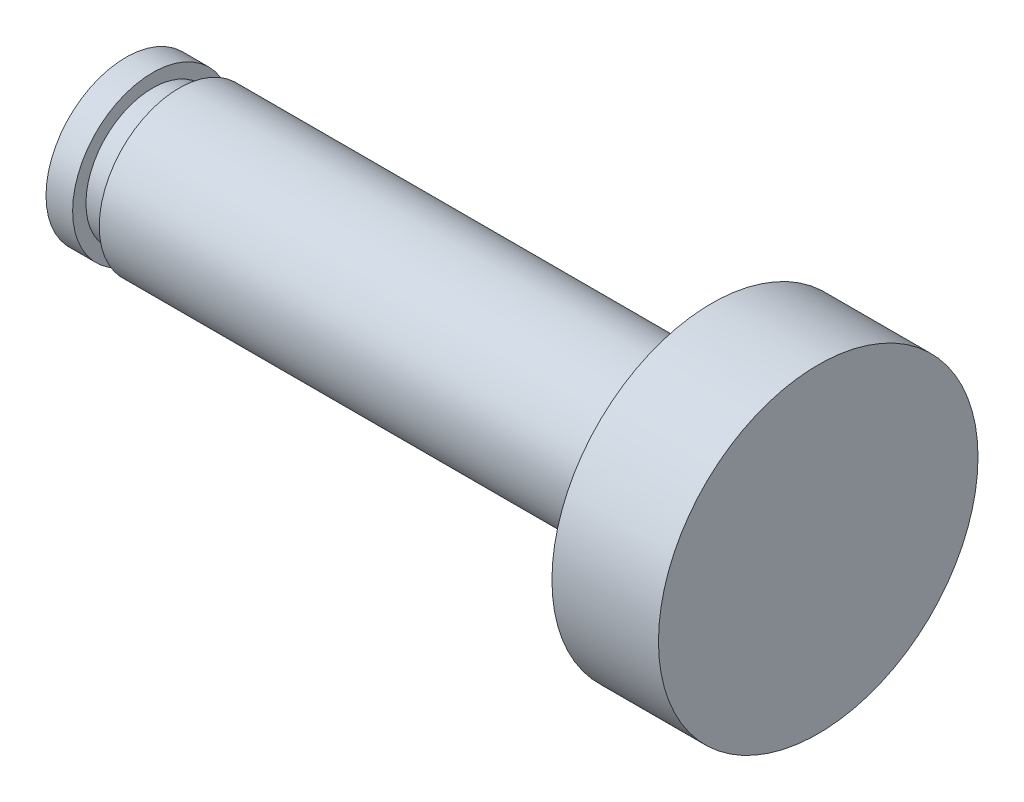
ISO-10303-21;
HEADER;
FILE_DESCRIPTION(('STEP AP214'),'2;1');
FILE_NAME('part.step','',(''),(''),'','','');
FILE_SCHEMA(('AUTOMOTIVE_DESIGN { 1 0 10303 214 1 1 1 1 }'));
ENDSEC;
DATA;
#1=APPLICATION_CONTEXT('core data for automotive mechanical design processes');
#2=APPLICATION_PROTOCOL_DEFINITION('international standard','automotive_design',2000,#1);
#3=PRODUCT_CONTEXT('',#1,'mechanical');
#4=PRODUCT('Part','Part','',(#3));
#5=PRODUCT_RELATED_PRODUCT_CATEGORY('part','',(#4));
#6=PRODUCT_DEFINITION_FORMATION('','',#4);
#7=PRODUCT_DEFINITION_CONTEXT('part definition',#1,'design');
#8=PRODUCT_DEFINITION('design','',#6,#7);
#9=PRODUCT_DEFINITION_SHAPE('','',#8);
#10=(LENGTH_UNIT() NAMED_UNIT(*) SI_UNIT(.MILLI.,.METRE.));
#11=(NAMED_UNIT(*) PLANE_ANGLE_UNIT() SI_UNIT($,.RADIAN.));
#12=(NAMED_UNIT(*) SI_UNIT($,.STERADIAN.) SOLID_ANGLE_UNIT());
#13=UNCERTAINTY_MEASURE_WITH_UNIT(LENGTH_MEASURE(1.E-05),#10,'distance_accuracy_value','');
#14=(GEOMETRIC_REPRESENTATION_CONTEXT(3) GLOBAL_UNCERTAINTY_ASSIGNED_CONTEXT((#13)) GLOBAL_UNIT_ASSIGNED_CONTEXT((#10,
#11,#12)) REPRESENTATION_CONTEXT('',''));
#15=CARTESIAN_POINT('',(0.,0.,0.));
#16=DIRECTION('',(0.,0.,1.));
#17=DIRECTION('',(1.,0.,0.));
#18=AXIS2_PLACEMENT_3D('',#15,#16,#17);
#19=CARTESIAN_POINT('',(0.,0.,-1.50000000000006));
#20=DIRECTION('',(1.,0.,0.));
#21=DIRECTION('',(0.,0.,-1.));
#22=AXIS2_PLACEMENT_3D('',#19,#20,#21);
#23=PLANE('',#22);
#24=CARTESIAN_POINT('',(1.83513322852231E-13,0.,0.));
#25=DIRECTION('',(-1.,0.,0.));
#26=DIRECTION('',(0.,0.,1.));
#27=AXIS2_PLACEMENT_3D('',#24,#25,#26);
#28=CIRCLE('',#27,1.50000000000006);
#29=CARTESIAN_POINT('',(1.83513322852231E-13,0.,1.50000000000006));
#30=VERTEX_POINT('',#29);
#31=EDGE_CURVE('E69',#30,#30,#28,.T.);
#32=ORIENTED_EDGE('',*,*,#31,.T.);
#33=EDGE_LOOP('',(#32));
#34=FACE_BOUND('',#33,.T.);
#35=ADVANCED_FACE('F41',(#34),#23,.F.);
#36=CARTESIAN_POINT('',(13.,0.,0.));
#37=DIRECTION('',(-1.,0.,0.));
#38=DIRECTION('',(0.,0.,1.));
#39=AXIS2_PLACEMENT_3D('',#36,#37,#38);
#40=PLANE('',#39);
#41=CARTESIAN_POINT('',(13.,0.,0.));
#42=DIRECTION('',(-1.,0.,0.));
#43=DIRECTION('',(0.,0.,1.));
#44=AXIS2_PLACEMENT_3D('',#41,#42,#43);
#45=CIRCLE('',#44,3.);
#46=CARTESIAN_POINT('',(13.,0.,3.));
#47=VERTEX_POINT('',#46);
#48=EDGE_CURVE('E10',#47,#47,#45,.T.);
#49=ORIENTED_EDGE('',*,*,#48,.F.);
#50=EDGE_LOOP('',(#49));
#51=FACE_BOUND('',#50,.T.);
#52=ADVANCED_FACE('F111',(#51),#40,.F.);
#53=CARTESIAN_POINT('',(0.,0.,0.));
#54=DIRECTION('',(-1.,0.,0.));
#55=DIRECTION('',(0.,0.,1.));
#56=AXIS2_PLACEMENT_3D('',#53,#54,#55);
#57=CYLINDRICAL_SURFACE('',#56,3.);
#58=CARTESIAN_POINT('',(11.,0.,0.));
#59=DIRECTION('',(-1.,0.,0.));
#60=DIRECTION('',(0.,0.,1.));
#61=AXIS2_PLACEMENT_3D('',#58,#59,#60);
#62=CIRCLE('',#61,3.);
#63=CARTESIAN_POINT('',(11.,0.,3.));
#64=VERTEX_POINT('',#63);
#65=EDGE_CURVE('E47',#64,#64,#62,.T.);
#66=ORIENTED_EDGE('',*,*,#65,.F.);
#67=EDGE_LOOP('',(#66));
#68=FACE_BOUND('',#67,.T.);
#69=ORIENTED_EDGE('',*,*,#48,.T.);
#70=EDGE_LOOP('',(#69));
#71=FACE_BOUND('',#70,.T.);
#72=ADVANCED_FACE('F106',(#68,#71),#57,.T.);
#73=CARTESIAN_POINT('',(11.,0.,-3.));
#74=DIRECTION('',(1.,0.,0.));
#75=DIRECTION('',(0.,0.,-1.));
#76=AXIS2_PLACEMENT_3D('',#73,#74,#75);
#77=PLANE('',#76);
#78=CARTESIAN_POINT('',(11.,0.,0.));
#79=DIRECTION('',(-1.,0.,0.));
#80=DIRECTION('',(0.,0.,1.));
#81=AXIS2_PLACEMENT_3D('',#78,#79,#80);
#82=CIRCLE('',#81,1.5);
#83=CARTESIAN_POINT('',(11.,0.,1.5));
#84=VERTEX_POINT('',#83);
#85=EDGE_CURVE('E51',#84,#84,#82,.T.);
#86=ORIENTED_EDGE('',*,*,#85,.F.);
#87=EDGE_LOOP('',(#86));
#88=FACE_BOUND('',#87,.T.);
#89=ORIENTED_EDGE('',*,*,#65,.T.);
#90=EDGE_LOOP('',(#89));
#91=FACE_BOUND('',#90,.T.);
#92=ADVANCED_FACE('F101',(#88,#91),#77,.F.);
#93=CARTESIAN_POINT('',(0.,0.,0.));
#94=DIRECTION('',(-1.,0.,0.));
#95=DIRECTION('',(0.,0.,1.));
#96=AXIS2_PLACEMENT_3D('',#93,#94,#95);
#97=CYLINDRICAL_SURFACE('',#96,1.5);
#98=CARTESIAN_POINT('',(0.999999999999999,0.,0.));
#99=DIRECTION('',(-1.,0.,0.));
#100=DIRECTION('',(0.,0.,1.));
#101=AXIS2_PLACEMENT_3D('',#98,#99,#100);
#102=CIRCLE('',#101,1.5);
#103=CARTESIAN_POINT('',(0.999999999999999,0.,1.5));
#104=VERTEX_POINT('',#103);
#105=EDGE_CURVE('E55',#104,#104,#102,.T.);
#106=ORIENTED_EDGE('',*,*,#105,.F.);
#107=EDGE_LOOP('',(#106));
#108=FACE_BOUND('',#107,.T.);
#109=ORIENTED_EDGE('',*,*,#85,.T.);
#110=EDGE_LOOP('',(#109));
#111=FACE_BOUND('',#110,.T.);
#112=ADVANCED_FACE('F95',(#108,#111),#97,.T.);
#113=CARTESIAN_POINT('',(0.999999999999999,0.,-1.5));
#114=DIRECTION('',(1.,0.,0.));
#115=DIRECTION('',(0.,0.,-1.));
#116=AXIS2_PLACEMENT_3D('',#113,#114,#115);
#117=PLANE('',#116);
#118=CARTESIAN_POINT('',(0.999999999999999,0.,0.));
#119=DIRECTION('',(-1.,0.,0.));
#120=DIRECTION('',(0.,0.,1.));
#121=AXIS2_PLACEMENT_3D('',#118,#119,#120);
#122=CIRCLE('',#121,1.25);
#123=CARTESIAN_POINT('',(0.999999999999999,0.,1.25));
#124=VERTEX_POINT('',#123);
#125=EDGE_CURVE('E60',#124,#124,#122,.T.);
#126=ORIENTED_EDGE('',*,*,#125,.F.);
#127=EDGE_LOOP('',(#126));
#128=FACE_BOUND('',#127,.T.);
#129=ORIENTED_EDGE('',*,*,#105,.T.);
#130=EDGE_LOOP('',(#129));
#131=FACE_BOUND('',#130,.T.);
#132=ADVANCED_FACE('F89',(#128,#131),#117,.F.);
#133=CARTESIAN_POINT('',(0.,0.,0.));
#134=DIRECTION('',(-1.,0.,0.));
#135=DIRECTION('',(0.,0.,1.));
#136=AXIS2_PLACEMENT_3D('',#133,#134,#135);
#137=CYLINDRICAL_SURFACE('',#136,1.25);
#138=CARTESIAN_POINT('',(0.5,0.,0.));
#139=DIRECTION('',(-1.,0.,0.));
#140=DIRECTION('',(0.,0.,1.));
#141=AXIS2_PLACEMENT_3D('',#138,#139,#140);
#142=CIRCLE('',#141,1.25);
#143=CARTESIAN_POINT('',(0.5,0.,1.25));
#144=VERTEX_POINT('',#143);
#145=EDGE_CURVE('E63',#144,#144,#142,.T.);
#146=ORIENTED_EDGE('',*,*,#145,.F.);
#147=EDGE_LOOP('',(#146));
#148=FACE_BOUND('',#147,.T.);
#149=ORIENTED_EDGE('',*,*,#125,.T.);
#150=EDGE_LOOP('',(#149));
#151=FACE_BOUND('',#150,.T.);
#152=ADVANCED_FACE('F83',(#148,#151),#137,.T.);
#153=CARTESIAN_POINT('',(0.5,0.,-1.5));
#154=DIRECTION('',(-1.,0.,0.));
#155=DIRECTION('',(0.,0.,1.));
#156=AXIS2_PLACEMENT_3D('',#153,#154,#155);
#157=PLANE('',#156);
#158=CARTESIAN_POINT('',(0.5,0.,0.));
#159=DIRECTION('',(-1.,0.,0.));
#160=DIRECTION('',(0.,0.,1.));
#161=AXIS2_PLACEMENT_3D('',#158,#159,#160);
#162=CIRCLE('',#161,1.5);
#163=CARTESIAN_POINT('',(0.5,0.,1.5));
#164=VERTEX_POINT('',#163);
#165=EDGE_CURVE('E66',#164,#164,#162,.T.);
#166=ORIENTED_EDGE('',*,*,#165,.F.);
#167=EDGE_LOOP('',(#166));
#168=FACE_BOUND('',#167,.T.);
#169=ORIENTED_EDGE('',*,*,#145,.T.);
#170=EDGE_LOOP('',(#169));
#171=FACE_BOUND('',#170,.T.);
#172=ADVANCED_FACE('F77',(#168,#171),#157,.F.);
#173=CARTESIAN_POINT('',(0.,0.,0.));
#174=DIRECTION('',(-1.,0.,0.));
#175=DIRECTION('',(0.,0.,1.));
#176=AXIS2_PLACEMENT_3D('',#173,#174,#175);
#177=CYLINDRICAL_SURFACE('',#176,1.50000000000003);
#178=ORIENTED_EDGE('',*,*,#31,.F.);
#179=EDGE_LOOP('',(#178));
#180=FACE_BOUND('',#179,.T.);
#181=ORIENTED_EDGE('',*,*,#165,.T.);
#182=EDGE_LOOP('',(#181));
#183=FACE_BOUND('',#182,.T.);
#184=ADVANCED_FACE('F74',(#180,#183),#177,.T.);
#185=CLOSED_SHELL('',(#35,#52,#72,#92,#112,#132,#152,#172,#184));
#186=MANIFOLD_SOLID_BREP('B2',#185);
#187=ADVANCED_BREP_SHAPE_REPRESENTATION('',(#18,#186),#14);
#188=SHAPE_DEFINITION_REPRESENTATION(#9,#187);
ENDSEC;
END-ISO-10303-21;
